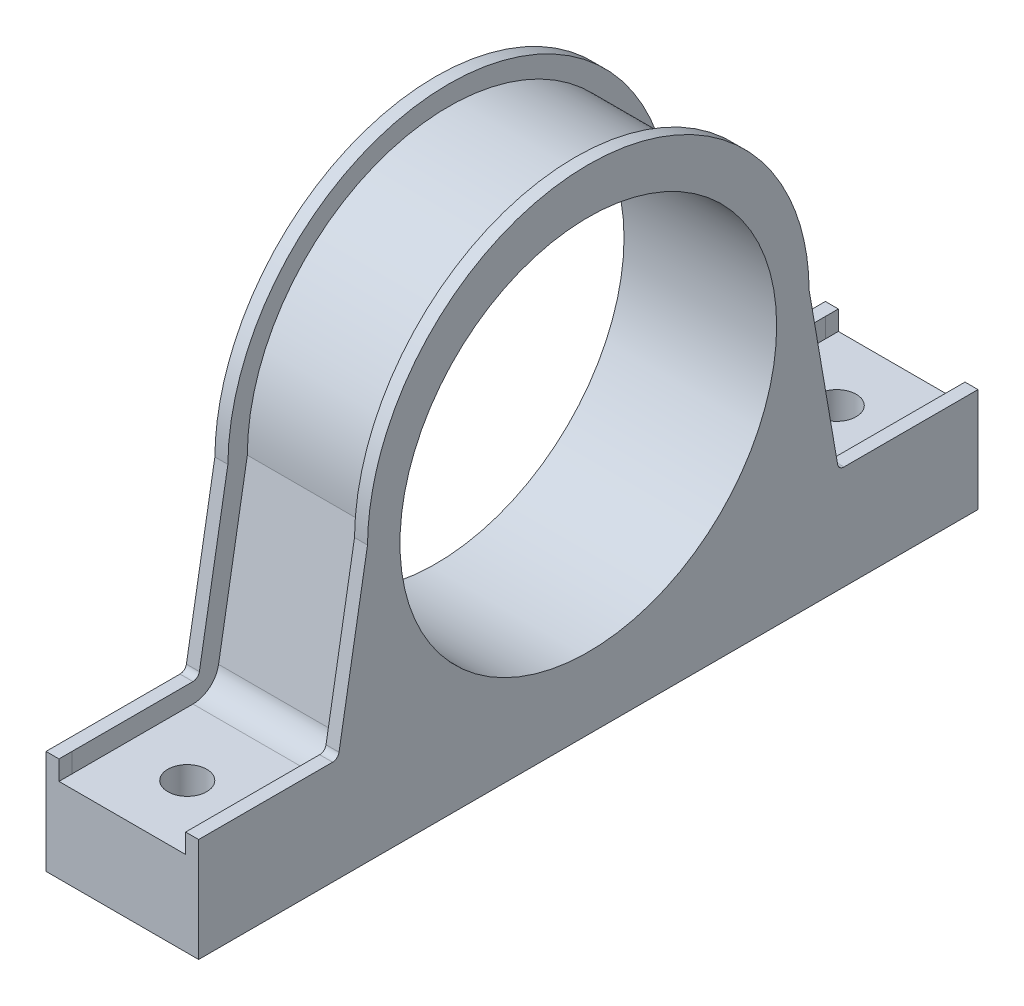
ISO-10303-21;
HEADER;
FILE_DESCRIPTION(('STEP AP214'),'2;1');
FILE_NAME('part.step','',(''),(''),'','','');
FILE_SCHEMA(('AUTOMOTIVE_DESIGN { 1 0 10303 214 1 1 1 1 }'));
ENDSEC;
DATA;
#1=APPLICATION_CONTEXT('core data for automotive mechanical design processes');
#2=APPLICATION_PROTOCOL_DEFINITION('international standard','automotive_design',2000,#1);
#3=PRODUCT_CONTEXT('',#1,'mechanical');
#4=PRODUCT('Part','Part','',(#3));
#5=PRODUCT_RELATED_PRODUCT_CATEGORY('part','',(#4));
#6=PRODUCT_DEFINITION_FORMATION('','',#4);
#7=PRODUCT_DEFINITION_CONTEXT('part definition',#1,'design');
#8=PRODUCT_DEFINITION('design','',#6,#7);
#9=PRODUCT_DEFINITION_SHAPE('','',#8);
#10=(LENGTH_UNIT() NAMED_UNIT(*) SI_UNIT(.MILLI.,.METRE.));
#11=(NAMED_UNIT(*) PLANE_ANGLE_UNIT() SI_UNIT($,.RADIAN.));
#12=(NAMED_UNIT(*) SI_UNIT($,.STERADIAN.) SOLID_ANGLE_UNIT());
#13=UNCERTAINTY_MEASURE_WITH_UNIT(LENGTH_MEASURE(1.E-05),#10,'distance_accuracy_value','');
#14=(GEOMETRIC_REPRESENTATION_CONTEXT(3) GLOBAL_UNCERTAINTY_ASSIGNED_CONTEXT((#13)) GLOBAL_UNIT_ASSIGNED_CONTEXT((#10,
#11,#12)) REPRESENTATION_CONTEXT('',''));
#15=CARTESIAN_POINT('',(0.,0.,0.));
#16=DIRECTION('',(0.,0.,1.));
#17=DIRECTION('',(1.,0.,0.));
#18=AXIS2_PLACEMENT_3D('',#15,#16,#17);
#19=CARTESIAN_POINT('',(23.5,0.,60.));
#20=DIRECTION('',(0.,0.,1.));
#21=DIRECTION('',(1.,0.,0.));
#22=AXIS2_PLACEMENT_3D('',#19,#20,#21);
#23=PLANE('',#22);
#24=DIRECTION('',(0.,1.,0.));
#25=VECTOR('',#24,1.);
#26=CARTESIAN_POINT('',(23.5,0.,60.));
#27=LINE('',#26,#25);
#28=CARTESIAN_POINT('',(23.5,-6.5,60.));
#29=VERTEX_POINT('',#28);
#30=CARTESIAN_POINT('',(23.5,9.5,60.));
#31=VERTEX_POINT('',#30);
#32=EDGE_CURVE('E377',#29,#31,#27,.T.);
#33=ORIENTED_EDGE('',*,*,#32,.T.);
#34=DIRECTION('',(1.,0.,0.));
#35=VECTOR('',#34,1.);
#36=CARTESIAN_POINT('',(0.,9.5,60.));
#37=LINE('',#36,#35);
#38=CARTESIAN_POINT('',(21.5,9.5,60.));
#39=VERTEX_POINT('',#38);
#40=EDGE_CURVE('E627',#39,#31,#37,.T.);
#41=ORIENTED_EDGE('',*,*,#40,.F.);
#42=DIRECTION('',(0.,1.,0.));
#43=VECTOR('',#42,1.);
#44=CARTESIAN_POINT('',(21.5,-500000.,60.));
#45=LINE('',#44,#43);
#46=CARTESIAN_POINT('',(21.5,6.5,60.));
#47=VERTEX_POINT('',#46);
#48=EDGE_CURVE('E521',#47,#39,#45,.T.);
#49=ORIENTED_EDGE('',*,*,#48,.F.);
#50=DIRECTION('',(-1.,0.,0.));
#51=VECTOR('',#50,1.);
#52=CARTESIAN_POINT('',(23.5,6.5,60.));
#53=LINE('',#52,#51);
#54=CARTESIAN_POINT('',(1.99999999999999,6.50000000001683,60.));
#55=VERTEX_POINT('',#54);
#56=EDGE_CURVE('E402',#47,#55,#53,.T.);
#57=ORIENTED_EDGE('',*,*,#56,.T.);
#58=DIRECTION('',(0.,1.,0.));
#59=VECTOR('',#58,1.);
#60=CARTESIAN_POINT('',(1.99999999999999,-500000.,60.));
#61=LINE('',#60,#59);
#62=CARTESIAN_POINT('',(1.99999999999999,9.50000000000273,60.));
#63=VERTEX_POINT('',#62);
#64=EDGE_CURVE('E323',#55,#63,#61,.T.);
#65=ORIENTED_EDGE('',*,*,#64,.T.);
#66=CARTESIAN_POINT('',(0.,9.5,60.));
#67=VERTEX_POINT('',#66);
#68=EDGE_CURVE('E51',#67,#63,#37,.T.);
#69=ORIENTED_EDGE('',*,*,#68,.F.);
#70=DIRECTION('',(0.,1.,0.));
#71=VECTOR('',#70,1.);
#72=CARTESIAN_POINT('',(0.,0.,60.));
#73=LINE('',#72,#71);
#74=CARTESIAN_POINT('',(0.,-6.5,60.));
#75=VERTEX_POINT('',#74);
#76=EDGE_CURVE('E319',#75,#67,#73,.T.);
#77=ORIENTED_EDGE('',*,*,#76,.F.);
#78=DIRECTION('',(-1.,0.,0.));
#79=VECTOR('',#78,1.);
#80=CARTESIAN_POINT('',(23.5,-6.5,60.));
#81=LINE('',#80,#79);
#82=EDGE_CURVE('E400',#29,#75,#81,.T.);
#83=ORIENTED_EDGE('',*,*,#82,.F.);
#84=EDGE_LOOP('',(#33,#41,#49,#57,#65,#69,#77,#83));
#85=FACE_BOUND('',#84,.T.);
#86=ADVANCED_FACE('F36',(#85),#23,.T.);
#87=CARTESIAN_POINT('',(23.5,0.,0.));
#88=DIRECTION('',(1.,0.,0.));
#89=DIRECTION('',(0.,0.,-1.));
#90=AXIS2_PLACEMENT_3D('',#87,#88,#89);
#91=PLANE('',#90);
#92=DIRECTION('',(0.,0.,1.));
#93=VECTOR('',#92,1.);
#94=CARTESIAN_POINT('',(23.5,9.5,0.));
#95=LINE('',#94,#93);
#96=CARTESIAN_POINT('',(23.5,9.5,39.369362474362));
#97=VERTEX_POINT('',#96);
#98=EDGE_CURVE('E634',#97,#31,#95,.T.);
#99=ORIENTED_EDGE('',*,*,#98,.T.);
#100=ORIENTED_EDGE('',*,*,#32,.F.);
#101=DIRECTION('',(0.,0.,-1.));
#102=VECTOR('',#101,1.);
#103=CARTESIAN_POINT('',(23.5,-6.5,0.));
#104=LINE('',#103,#102);
#105=CARTESIAN_POINT('',(23.5,-6.5,-60.));
#106=VERTEX_POINT('',#105);
#107=EDGE_CURVE('E381',#29,#106,#104,.T.);
#108=ORIENTED_EDGE('',*,*,#107,.T.);
#109=DIRECTION('',(0.,1.,0.));
#110=VECTOR('',#109,1.);
#111=CARTESIAN_POINT('',(23.5,0.,-60.));
#112=LINE('',#111,#110);
#113=CARTESIAN_POINT('',(23.5,9.5,-60.));
#114=VERTEX_POINT('',#113);
#115=EDGE_CURVE('E384',#106,#114,#112,.T.);
#116=ORIENTED_EDGE('',*,*,#115,.T.);
#117=DIRECTION('',(0.,0.,-1.));
#118=VECTOR('',#117,1.);
#119=CARTESIAN_POINT('',(23.5,9.5,0.));
#120=LINE('',#119,#118);
#121=CARTESIAN_POINT('',(23.5,9.5,-39.369362474362));
#122=VERTEX_POINT('',#121);
#123=EDGE_CURVE('E320',#122,#114,#120,.T.);
#124=ORIENTED_EDGE('',*,*,#123,.F.);
#125=CARTESIAN_POINT('',(23.5,10.5,-39.369362474362));
#126=DIRECTION('',(1.,0.,0.));
#127=DIRECTION('',(0.,0.,-1.));
#128=AXIS2_PLACEMENT_3D('',#125,#126,#127);
#129=CIRCLE('',#128,1.);
#130=CARTESIAN_POINT('',(23.5,10.330093083493,-38.3839023586175));
#131=VERTEX_POINT('',#130);
#132=EDGE_CURVE('E619',#131,#122,#129,.T.);
#133=ORIENTED_EDGE('',*,*,#132,.F.);
#134=DIRECTION('',(0.,0.985460115744309,0.169906916507871));
#135=VECTOR('',#134,1.);
#136=CARTESIAN_POINT('',(23.5,6.7250787171994,-39.0054565597035));
#137=LINE('',#136,#135);
#138=CARTESIAN_POINT('',(23.5,27.4770990914213,-35.4275220124189));
#139=VERTEX_POINT('',#138);
#140=EDGE_CURVE('E453',#131,#139,#137,.T.);
#141=ORIENTED_EDGE('',*,*,#140,.T.);
#142=CARTESIAN_POINT('',(23.5,35.7626090324103,-33.9989858156948));
#143=VERTEX_POINT('',#142);
#144=EDGE_CURVE('E660',#139,#143,#137,.T.);
#145=ORIENTED_EDGE('',*,*,#144,.T.);
#146=CARTESIAN_POINT('',(23.5,35.5,0.));
#147=DIRECTION('',(1.,0.,0.));
#148=DIRECTION('',(0.,0.,-1.));
#149=AXIS2_PLACEMENT_3D('',#146,#147,#148);
#150=CIRCLE('',#149,33.9999999999959);
#151=CARTESIAN_POINT('',(23.5,49.4642400437589,-31.));
#152=VERTEX_POINT('',#151);
#153=EDGE_CURVE('E658',#143,#152,#150,.T.);
#154=ORIENTED_EDGE('',*,*,#153,.T.);
#155=CARTESIAN_POINT('',(23.5,49.4642400437589,31.));
#156=VERTEX_POINT('',#155);
#157=EDGE_CURVE('E661',#152,#156,#150,.T.);
#158=ORIENTED_EDGE('',*,*,#157,.T.);
#159=CARTESIAN_POINT('',(23.5,35.7626090324465,33.9989858156945));
#160=VERTEX_POINT('',#159);
#161=EDGE_CURVE('E657',#156,#160,#150,.T.);
#162=ORIENTED_EDGE('',*,*,#161,.T.);
#163=DIRECTION('',(0.,0.985460115744348,-0.169906916507646));
#164=VECTOR('',#163,1.);
#165=CARTESIAN_POINT('',(23.5,6.72507871719035,39.0054565597042));
#166=LINE('',#165,#164);
#167=CARTESIAN_POINT('',(23.5,27.4770990970526,35.4275220114521));
#168=VERTEX_POINT('',#167);
#169=EDGE_CURVE('E654',#168,#160,#166,.T.);
#170=ORIENTED_EDGE('',*,*,#169,.F.);
#171=CARTESIAN_POINT('',(23.5,10.3300930834924,38.3839023586176));
#172=VERTEX_POINT('',#171);
#173=EDGE_CURVE('E655',#172,#168,#166,.T.);
#174=ORIENTED_EDGE('',*,*,#173,.F.);
#175=CARTESIAN_POINT('',(23.5,10.5,39.369362474362));
#176=DIRECTION('',(1.,0.,0.));
#177=DIRECTION('',(0.,0.,-1.));
#178=AXIS2_PLACEMENT_3D('',#175,#176,#177);
#179=CIRCLE('',#178,0.999999999999999);
#180=EDGE_CURVE('E640',#97,#172,#179,.T.);
#181=ORIENTED_EDGE('',*,*,#180,.F.);
#182=EDGE_LOOP('',(#99,#100,#108,#116,#124,#133,#141,#145,#154,#158,#162,#170,#174,#181));
#183=FACE_BOUND('',#182,.T.);
#184=CARTESIAN_POINT('',(23.5,33.5,0.));
#185=DIRECTION('',(1.,0.,0.));
#186=DIRECTION('',(0.,0.,-1.));
#187=AXIS2_PLACEMENT_3D('',#184,#185,#186);
#188=CIRCLE('',#187,29.);
#189=CARTESIAN_POINT('',(23.5,33.5,-29.));
#190=VERTEX_POINT('',#189);
#191=EDGE_CURVE('E374',#190,#190,#188,.T.);
#192=ORIENTED_EDGE('',*,*,#191,.F.);
#193=EDGE_LOOP('',(#192));
#194=FACE_BOUND('',#193,.T.);
#195=ADVANCED_FACE('F622',(#183,#194),#91,.T.);
#196=CARTESIAN_POINT('',(0.,0.,0.));
#197=DIRECTION('',(1.,0.,0.));
#198=DIRECTION('',(0.,0.,-1.));
#199=AXIS2_PLACEMENT_3D('',#196,#197,#198);
#200=PLANE('',#199);
#201=CARTESIAN_POINT('',(0.,33.5,0.));
#202=DIRECTION('',(1.,0.,0.));
#203=DIRECTION('',(0.,0.,-1.));
#204=AXIS2_PLACEMENT_3D('',#201,#202,#203);
#205=CIRCLE('',#204,29.);
#206=CARTESIAN_POINT('',(0.,33.5,-29.));
#207=VERTEX_POINT('',#206);
#208=EDGE_CURVE('E373',#207,#207,#205,.T.);
#209=ORIENTED_EDGE('',*,*,#208,.T.);
#210=EDGE_LOOP('',(#209));
#211=FACE_BOUND('',#210,.T.);
#212=DIRECTION('',(0.,0.,-1.));
#213=VECTOR('',#212,1.);
#214=CARTESIAN_POINT('',(0.,9.5,0.));
#215=LINE('',#214,#213);
#216=CARTESIAN_POINT('',(0.,9.5,-39.369362474362));
#217=VERTEX_POINT('',#216);
#218=CARTESIAN_POINT('',(0.,9.5,-60.));
#219=VERTEX_POINT('',#218);
#220=EDGE_CURVE('E612',#217,#219,#215,.T.);
#221=ORIENTED_EDGE('',*,*,#220,.T.);
#222=DIRECTION('',(0.,1.,0.));
#223=VECTOR('',#222,1.);
#224=CARTESIAN_POINT('',(0.,0.,-60.));
#225=LINE('',#224,#223);
#226=CARTESIAN_POINT('',(0.,-6.5,-60.));
#227=VERTEX_POINT('',#226);
#228=EDGE_CURVE('E378',#227,#219,#225,.T.);
#229=ORIENTED_EDGE('',*,*,#228,.F.);
#230=DIRECTION('',(0.,0.,-1.));
#231=VECTOR('',#230,1.);
#232=CARTESIAN_POINT('',(0.,-6.5,0.));
#233=LINE('',#232,#231);
#234=EDGE_CURVE('E391',#75,#227,#233,.T.);
#235=ORIENTED_EDGE('',*,*,#234,.F.);
#236=ORIENTED_EDGE('',*,*,#76,.T.);
#237=DIRECTION('',(0.,0.,1.));
#238=VECTOR('',#237,1.);
#239=CARTESIAN_POINT('',(0.,9.5,0.));
#240=LINE('',#239,#238);
#241=CARTESIAN_POINT('',(0.,9.5,39.369362474362));
#242=VERTEX_POINT('',#241);
#243=EDGE_CURVE('E294',#242,#67,#240,.T.);
#244=ORIENTED_EDGE('',*,*,#243,.F.);
#245=CARTESIAN_POINT('',(0.,10.5,39.369362474362));
#246=DIRECTION('',(1.,0.,0.));
#247=DIRECTION('',(0.,0.,-1.));
#248=AXIS2_PLACEMENT_3D('',#245,#246,#247);
#249=CIRCLE('',#248,0.999999999999999);
#250=CARTESIAN_POINT('',(0.,10.3300930834924,38.3839023586176));
#251=VERTEX_POINT('',#250);
#252=EDGE_CURVE('E303',#242,#251,#249,.T.);
#253=ORIENTED_EDGE('',*,*,#252,.T.);
#254=DIRECTION('',(0.,0.985460115744348,-0.169906916507646));
#255=VECTOR('',#254,1.);
#256=CARTESIAN_POINT('',(0.,6.72507871719035,39.0054565597042));
#257=LINE('',#256,#255);
#258=CARTESIAN_POINT('',(0.,27.4770990970526,35.4275220114521));
#259=VERTEX_POINT('',#258);
#260=EDGE_CURVE('E1058',#251,#259,#257,.T.);
#261=ORIENTED_EDGE('',*,*,#260,.T.);
#262=CARTESIAN_POINT('',(0.,35.7626090324465,33.9989858156945));
#263=VERTEX_POINT('',#262);
#264=EDGE_CURVE('E311',#259,#263,#257,.T.);
#265=ORIENTED_EDGE('',*,*,#264,.T.);
#266=CARTESIAN_POINT('',(0.,35.5,0.));
#267=DIRECTION('',(1.,0.,0.));
#268=DIRECTION('',(0.,0.,-1.));
#269=AXIS2_PLACEMENT_3D('',#266,#267,#268);
#270=CIRCLE('',#269,33.9999999999959);
#271=CARTESIAN_POINT('',(0.,49.4642400437589,31.));
#272=VERTEX_POINT('',#271);
#273=EDGE_CURVE('E1056',#272,#263,#270,.T.);
#274=ORIENTED_EDGE('',*,*,#273,.F.);
#275=CARTESIAN_POINT('',(0.,49.4642400437589,-31.));
#276=VERTEX_POINT('',#275);
#277=EDGE_CURVE('E1054',#276,#272,#270,.T.);
#278=ORIENTED_EDGE('',*,*,#277,.F.);
#279=CARTESIAN_POINT('',(0.,35.7626090324103,-33.9989858156948));
#280=VERTEX_POINT('',#279);
#281=EDGE_CURVE('E1053',#280,#276,#270,.T.);
#282=ORIENTED_EDGE('',*,*,#281,.F.);
#283=DIRECTION('',(0.,0.985460115744309,0.169906916507871));
#284=VECTOR('',#283,1.);
#285=CARTESIAN_POINT('',(0.,6.7250787171994,-39.0054565597035));
#286=LINE('',#285,#284);
#287=CARTESIAN_POINT('',(0.,27.4770990914213,-35.4275220124189));
#288=VERTEX_POINT('',#287);
#289=EDGE_CURVE('E1051',#288,#280,#286,.T.);
#290=ORIENTED_EDGE('',*,*,#289,.F.);
#291=CARTESIAN_POINT('',(0.,10.330093083493,-38.3839023586175));
#292=VERTEX_POINT('',#291);
#293=EDGE_CURVE('E648',#292,#288,#286,.T.);
#294=ORIENTED_EDGE('',*,*,#293,.F.);
#295=CARTESIAN_POINT('',(0.,10.5,-39.369362474362));
#296=DIRECTION('',(1.,0.,0.));
#297=DIRECTION('',(0.,0.,-1.));
#298=AXIS2_PLACEMENT_3D('',#295,#296,#297);
#299=CIRCLE('',#298,1.);
#300=EDGE_CURVE('E646',#292,#217,#299,.T.);
#301=ORIENTED_EDGE('',*,*,#300,.T.);
#302=EDGE_LOOP('',(#221,#229,#235,#236,#244,#253,#261,#265,#274,#278,#282,#290,#294,#301));
#303=FACE_BOUND('',#302,.T.);
#304=ADVANCED_FACE('F315',(#211,#303),#200,.F.);
#305=CARTESIAN_POINT('',(1.99999999999999,-500000.,58.));
#306=DIRECTION('',(-1.,0.,0.));
#307=DIRECTION('',(0.,0.,1.));
#308=AXIS2_PLACEMENT_3D('',#305,#306,#307);
#309=PLANE('',#308);
#310=DIRECTION('',(0.,0.,-1.));
#311=VECTOR('',#310,1.);
#312=CARTESIAN_POINT('',(1.99999999999999,9.50000000000273,58.));
#313=LINE('',#312,#311);
#314=CARTESIAN_POINT('',(1.99999999999999,9.50000000000273,58.));
#315=VERTEX_POINT('',#314);
#316=CARTESIAN_POINT('',(1.99999999999999,9.5,39.369362474362));
#317=VERTEX_POINT('',#316);
#318=EDGE_CURVE('E296',#315,#317,#313,.T.);
#319=ORIENTED_EDGE('',*,*,#318,.F.);
#320=DIRECTION('',(0.,1.,0.));
#321=VECTOR('',#320,1.);
#322=CARTESIAN_POINT('',(1.99999999999999,-500000.,58.));
#323=LINE('',#322,#321);
#324=CARTESIAN_POINT('',(1.99999999999999,6.50000000001683,58.));
#325=VERTEX_POINT('',#324);
#326=EDGE_CURVE('E329',#325,#315,#323,.T.);
#327=ORIENTED_EDGE('',*,*,#326,.F.);
#328=DIRECTION('',(0.,0.,-1.));
#329=VECTOR('',#328,1.);
#330=CARTESIAN_POINT('',(1.99999999999999,6.50000000001683,58.));
#331=LINE('',#330,#329);
#332=CARTESIAN_POINT('',(1.99999999999999,6.5,39.369362474362));
#333=VERTEX_POINT('',#332);
#334=EDGE_CURVE('E347',#325,#333,#331,.T.);
#335=ORIENTED_EDGE('',*,*,#334,.T.);
#336=CARTESIAN_POINT('',(1.99999999999999,10.5,39.369362474362));
#337=DIRECTION('',(-1.,0.,0.));
#338=DIRECTION('',(0.,0.,1.));
#339=AXIS2_PLACEMENT_3D('',#336,#337,#338);
#340=CIRCLE('',#339,4.);
#341=CARTESIAN_POINT('',(1.99999999999999,9.82037233393385,35.4275220113891));
#342=VERTEX_POINT('',#341);
#343=EDGE_CURVE('E348',#342,#333,#340,.T.);
#344=ORIENTED_EDGE('',*,*,#343,.F.);
#345=DIRECTION('',(0.,-0.985460115744348,0.169906916507646));
#346=VECTOR('',#345,1.);
#347=CARTESIAN_POINT('',(1.99999999999999,-485569.315819862,83755.9682448035));
#348=LINE('',#347,#346);
#349=CARTESIAN_POINT('',(1.99999999999999,35.5,31.));
#350=VERTEX_POINT('',#349);
#351=EDGE_CURVE('E351',#350,#342,#348,.T.);
#352=ORIENTED_EDGE('',*,*,#351,.F.);
#353=CARTESIAN_POINT('',(1.99999999999999,35.5,0.));
#354=DIRECTION('',(-1.,0.,0.));
#355=DIRECTION('',(0.,0.,1.));
#356=AXIS2_PLACEMENT_3D('',#353,#354,#355);
#357=CIRCLE('',#356,31.);
#358=CARTESIAN_POINT('',(1.99999999999999,35.5000000000132,-30.9999999999917));
#359=VERTEX_POINT('',#358);
#360=EDGE_CURVE('E357',#359,#350,#357,.F.);
#361=ORIENTED_EDGE('',*,*,#360,.F.);
#362=DIRECTION('',(0.,-0.985460115744348,-0.169906916507646));
#363=VECTOR('',#362,1.);
#364=CARTESIAN_POINT('',(1.99999999999999,-485549.893187067,-83752.6195150116));
#365=LINE('',#364,#363);
#366=CARTESIAN_POINT('',(1.99999999999999,9.82037233393385,-35.4275220113891));
#367=VERTEX_POINT('',#366);
#368=EDGE_CURVE('E546',#359,#367,#365,.T.);
#369=ORIENTED_EDGE('',*,*,#368,.T.);
#370=CARTESIAN_POINT('',(1.99999999999999,10.5,-39.369362474362));
#371=DIRECTION('',(-1.,0.,0.));
#372=DIRECTION('',(0.,0.,1.));
#373=AXIS2_PLACEMENT_3D('',#370,#371,#372);
#374=CIRCLE('',#373,4.);
#375=CARTESIAN_POINT('',(1.99999999999999,6.5,-39.369362474362));
#376=VERTEX_POINT('',#375);
#377=EDGE_CURVE('E360',#376,#367,#374,.T.);
#378=ORIENTED_EDGE('',*,*,#377,.F.);
#379=DIRECTION('',(0.,0.,1.));
#380=VECTOR('',#379,1.);
#381=CARTESIAN_POINT('',(1.99999999999999,6.50000000001683,58.));
#382=LINE('',#381,#380);
#383=CARTESIAN_POINT('',(1.99999999999999,6.50000000001683,-58.));
#384=VERTEX_POINT('',#383);
#385=EDGE_CURVE('E354',#384,#376,#382,.T.);
#386=ORIENTED_EDGE('',*,*,#385,.F.);
#387=DIRECTION('',(0.,1.,0.));
#388=VECTOR('',#387,1.);
#389=CARTESIAN_POINT('',(1.99999999999999,-500000.,-58.));
#390=LINE('',#389,#388);
#391=CARTESIAN_POINT('',(1.99999999999999,9.50000000000273,-58.));
#392=VERTEX_POINT('',#391);
#393=EDGE_CURVE('E554',#384,#392,#390,.T.);
#394=ORIENTED_EDGE('',*,*,#393,.T.);
#395=DIRECTION('',(0.,0.,1.));
#396=VECTOR('',#395,1.);
#397=CARTESIAN_POINT('',(1.99999999999999,9.50000000000273,58.));
#398=LINE('',#397,#396);
#399=CARTESIAN_POINT('',(1.99999999999999,9.5,-39.369362474362));
#400=VERTEX_POINT('',#399);
#401=EDGE_CURVE('E472',#392,#400,#398,.T.);
#402=ORIENTED_EDGE('',*,*,#401,.T.);
#403=CARTESIAN_POINT('',(1.99999999999999,10.5,-39.369362474362));
#404=DIRECTION('',(-1.,0.,0.));
#405=DIRECTION('',(0.,0.,1.));
#406=AXIS2_PLACEMENT_3D('',#403,#404,#405);
#407=CIRCLE('',#406,1.);
#408=CARTESIAN_POINT('',(1.99999999999999,10.330093083493,-38.3839023586175));
#409=VERTEX_POINT('',#408);
#410=EDGE_CURVE('E487',#400,#409,#407,.T.);
#411=ORIENTED_EDGE('',*,*,#410,.T.);
#412=DIRECTION('',(0.,-0.985460115744309,-0.169906916507871));
#413=VECTOR('',#412,1.);
#414=CARTESIAN_POINT('',(1.99999999999999,-485549.383466279,-83755.5758954661));
#415=LINE('',#414,#413);
#416=CARTESIAN_POINT('',(1.99999999999999,35.7626090324103,-33.9989858156948));
#417=VERTEX_POINT('',#416);
#418=EDGE_CURVE('E485',#417,#409,#415,.T.);
#419=ORIENTED_EDGE('',*,*,#418,.F.);
#420=CARTESIAN_POINT('',(1.99999999999999,35.5,0.));
#421=DIRECTION('',(-1.,0.,0.));
#422=DIRECTION('',(0.,0.,1.));
#423=AXIS2_PLACEMENT_3D('',#420,#421,#422);
#424=CIRCLE('',#423,33.9999999999959);
#425=CARTESIAN_POINT('',(1.99999999999999,35.7626090324465,33.9989858156945));
#426=VERTEX_POINT('',#425);
#427=EDGE_CURVE('E483',#426,#417,#424,.T.);
#428=ORIENTED_EDGE('',*,*,#427,.F.);
#429=DIRECTION('',(0.,-0.985460115744348,0.169906916507646));
#430=VECTOR('',#429,1.);
#431=CARTESIAN_POINT('',(1.99999999999999,-485568.806099112,83758.9246251507));
#432=LINE('',#431,#430);
#433=CARTESIAN_POINT('',(1.99999999999999,10.3300930834924,38.3839023586176));
#434=VERTEX_POINT('',#433);
#435=EDGE_CURVE('E480',#426,#434,#432,.T.);
#436=ORIENTED_EDGE('',*,*,#435,.T.);
#437=CARTESIAN_POINT('',(1.99999999999999,10.5,39.369362474362));
#438=DIRECTION('',(-1.,0.,0.));
#439=DIRECTION('',(0.,0.,1.));
#440=AXIS2_PLACEMENT_3D('',#437,#438,#439);
#441=CIRCLE('',#440,0.999999999999999);
#442=EDGE_CURVE('E478',#434,#317,#441,.T.);
#443=ORIENTED_EDGE('',*,*,#442,.T.);
#444=EDGE_LOOP('',(#319,#327,#335,#344,#352,#361,#369,#378,#386,#394,#402,#411,#419,#428,#436,#443));
#445=FACE_BOUND('',#444,.T.);
#446=ADVANCED_FACE('F564',(#445),#309,.F.);
#447=CARTESIAN_POINT('',(1.99999999999999,-500000.,58.));
#448=DIRECTION('',(-1.,0.,0.));
#449=DIRECTION('',(0.,0.,1.));
#450=AXIS2_PLACEMENT_3D('',#447,#448,#449);
#451=PLANE('',#450);
#452=DIRECTION('',(0.,0.,-1.));
#453=VECTOR('',#452,1.);
#454=CARTESIAN_POINT('',(1.99999999999999,9.50000000000273,58.));
#455=LINE('',#454,#453);
#456=EDGE_CURVE('E492',#63,#315,#455,.T.);
#457=ORIENTED_EDGE('',*,*,#456,.F.);
#458=ORIENTED_EDGE('',*,*,#64,.F.);
#459=DIRECTION('',(0.,0.,-1.));
#460=VECTOR('',#459,1.);
#461=CARTESIAN_POINT('',(1.99999999999999,6.50000000001683,58.));
#462=LINE('',#461,#460);
#463=EDGE_CURVE('E547',#55,#325,#462,.T.);
#464=ORIENTED_EDGE('',*,*,#463,.T.);
#465=ORIENTED_EDGE('',*,*,#326,.T.);
#466=EDGE_LOOP('',(#457,#458,#464,#465));
#467=FACE_BOUND('',#466,.T.);
#468=ADVANCED_FACE('F559',(#467),#451,.F.);
#469=CARTESIAN_POINT('',(21.5,-500000.,58.));
#470=DIRECTION('',(1.,0.,0.));
#471=DIRECTION('',(0.,0.,-1.));
#472=AXIS2_PLACEMENT_3D('',#469,#470,#471);
#473=PLANE('',#472);
#474=DIRECTION('',(0.,0.,1.));
#475=VECTOR('',#474,1.);
#476=CARTESIAN_POINT('',(21.5,9.50000000000273,58.));
#477=LINE('',#476,#475);
#478=CARTESIAN_POINT('',(21.5,9.50000000000273,58.));
#479=VERTEX_POINT('',#478);
#480=EDGE_CURVE('E490',#479,#39,#477,.T.);
#481=ORIENTED_EDGE('',*,*,#480,.F.);
#482=DIRECTION('',(0.,1.,0.));
#483=VECTOR('',#482,1.);
#484=CARTESIAN_POINT('',(21.5,-500000.,58.));
#485=LINE('',#484,#483);
#486=CARTESIAN_POINT('',(21.5,6.5,58.));
#487=VERTEX_POINT('',#486);
#488=EDGE_CURVE('E524',#487,#479,#485,.T.);
#489=ORIENTED_EDGE('',*,*,#488,.F.);
#490=DIRECTION('',(0.,0.,1.));
#491=VECTOR('',#490,1.);
#492=CARTESIAN_POINT('',(21.5,6.50000000001683,58.));
#493=LINE('',#492,#491);
#494=EDGE_CURVE('E496',#487,#47,#493,.T.);
#495=ORIENTED_EDGE('',*,*,#494,.T.);
#496=ORIENTED_EDGE('',*,*,#48,.T.);
#497=EDGE_LOOP('',(#481,#489,#495,#496));
#498=FACE_BOUND('',#497,.T.);
#499=ADVANCED_FACE('F678',(#498),#473,.F.);
#500=CARTESIAN_POINT('',(21.5,-500000.,58.));
#501=DIRECTION('',(1.,0.,0.));
#502=DIRECTION('',(0.,0.,-1.));
#503=AXIS2_PLACEMENT_3D('',#500,#501,#502);
#504=PLANE('',#503);
#505=DIRECTION('',(0.,0.,1.));
#506=VECTOR('',#505,1.);
#507=CARTESIAN_POINT('',(21.5,9.50000000000273,58.));
#508=LINE('',#507,#506);
#509=CARTESIAN_POINT('',(21.5,9.5,39.369362474362));
#510=VERTEX_POINT('',#509);
#511=EDGE_CURVE('E11',#510,#479,#508,.T.);
#512=ORIENTED_EDGE('',*,*,#511,.F.);
#513=CARTESIAN_POINT('',(21.5,10.5,39.369362474362));
#514=DIRECTION('',(1.,0.,0.));
#515=DIRECTION('',(0.,0.,-1.));
#516=AXIS2_PLACEMENT_3D('',#513,#514,#515);
#517=CIRCLE('',#516,0.999999999999999);
#518=CARTESIAN_POINT('',(21.5,10.3300930834924,38.3839023586176));
#519=VERTEX_POINT('',#518);
#520=EDGE_CURVE('E422',#510,#519,#517,.T.);
#521=ORIENTED_EDGE('',*,*,#520,.T.);
#522=DIRECTION('',(0.,0.985460115744348,-0.169906916507646));
#523=VECTOR('',#522,1.);
#524=CARTESIAN_POINT('',(21.49999999997,-485568.806099112,83758.9246251507));
#525=LINE('',#524,#523);
#526=CARTESIAN_POINT('',(21.5,35.7626090324465,33.9989858156945));
#527=VERTEX_POINT('',#526);
#528=EDGE_CURVE('E425',#519,#527,#525,.T.);
#529=ORIENTED_EDGE('',*,*,#528,.T.);
#530=CARTESIAN_POINT('',(21.5,35.5,0.));
#531=DIRECTION('',(1.,0.,0.));
#532=DIRECTION('',(0.,0.,-1.));
#533=AXIS2_PLACEMENT_3D('',#530,#531,#532);
#534=CIRCLE('',#533,33.9999999999959);
#535=CARTESIAN_POINT('',(21.5,35.7626090324103,-33.9989858156948));
#536=VERTEX_POINT('',#535);
#537=EDGE_CURVE('E428',#536,#527,#534,.T.);
#538=ORIENTED_EDGE('',*,*,#537,.F.);
#539=DIRECTION('',(0.,0.985460115744309,0.169906916507871));
#540=VECTOR('',#539,1.);
#541=CARTESIAN_POINT('',(21.5000000000301,-485549.383466279,-83755.5758954661));
#542=LINE('',#541,#540);
#543=CARTESIAN_POINT('',(21.5,10.330093083493,-38.3839023586175));
#544=VERTEX_POINT('',#543);
#545=EDGE_CURVE('E430',#544,#536,#542,.T.);
#546=ORIENTED_EDGE('',*,*,#545,.F.);
#547=CARTESIAN_POINT('',(21.5,10.5,-39.369362474362));
#548=DIRECTION('',(1.,0.,0.));
#549=DIRECTION('',(0.,0.,-1.));
#550=AXIS2_PLACEMENT_3D('',#547,#548,#549);
#551=CIRCLE('',#550,1.);
#552=CARTESIAN_POINT('',(21.5,9.5,-39.369362474362));
#553=VERTEX_POINT('',#552);
#554=EDGE_CURVE('E44',#544,#553,#551,.T.);
#555=ORIENTED_EDGE('',*,*,#554,.T.);
#556=DIRECTION('',(0.,0.,-1.));
#557=VECTOR('',#556,1.);
#558=CARTESIAN_POINT('',(21.5,9.50000000000273,58.));
#559=LINE('',#558,#557);
#560=CARTESIAN_POINT('',(21.5000000000001,9.50000000000273,-58.));
#561=VERTEX_POINT('',#560);
#562=EDGE_CURVE('E438',#553,#561,#559,.T.);
#563=ORIENTED_EDGE('',*,*,#562,.T.);
#564=DIRECTION('',(0.,1.,0.));
#565=VECTOR('',#564,1.);
#566=CARTESIAN_POINT('',(21.5000000000001,-500000.,-58.));
#567=LINE('',#566,#565);
#568=CARTESIAN_POINT('',(21.5000000000001,6.5,-58.));
#569=VERTEX_POINT('',#568);
#570=EDGE_CURVE('E527',#569,#561,#567,.T.);
#571=ORIENTED_EDGE('',*,*,#570,.F.);
#572=DIRECTION('',(0.,0.,-1.));
#573=VECTOR('',#572,1.);
#574=CARTESIAN_POINT('',(21.5,6.50000000001683,58.));
#575=LINE('',#574,#573);
#576=CARTESIAN_POINT('',(21.5,6.5,-39.369362474362));
#577=VERTEX_POINT('',#576);
#578=EDGE_CURVE('E500',#577,#569,#575,.T.);
#579=ORIENTED_EDGE('',*,*,#578,.F.);
#580=CARTESIAN_POINT('',(21.5,10.5,-39.369362474362));
#581=DIRECTION('',(1.,0.,0.));
#582=DIRECTION('',(0.,0.,-1.));
#583=AXIS2_PLACEMENT_3D('',#580,#581,#582);
#584=CIRCLE('',#583,4.);
#585=CARTESIAN_POINT('',(21.5,9.82037233396941,-35.4275220113846));
#586=VERTEX_POINT('',#585);
#587=EDGE_CURVE('E541',#586,#577,#584,.T.);
#588=ORIENTED_EDGE('',*,*,#587,.F.);
#589=DIRECTION('',(0.,0.985460115744348,0.169906916507646));
#590=VECTOR('',#589,1.);
#591=CARTESIAN_POINT('',(21.5000000000301,-485549.893187067,-83752.6195150116));
#592=LINE('',#591,#590);
#593=CARTESIAN_POINT('',(21.5,35.5,-31.));
#594=VERTEX_POINT('',#593);
#595=EDGE_CURVE('E503',#586,#594,#592,.T.);
#596=ORIENTED_EDGE('',*,*,#595,.T.);
#597=CARTESIAN_POINT('',(21.5,35.5,0.));
#598=DIRECTION('',(1.,0.,0.));
#599=DIRECTION('',(0.,0.,-1.));
#600=AXIS2_PLACEMENT_3D('',#597,#598,#599);
#601=CIRCLE('',#600,31.);
#602=CARTESIAN_POINT('',(21.5,35.5,31.));
#603=VERTEX_POINT('',#602);
#604=EDGE_CURVE('E539',#603,#594,#601,.F.);
#605=ORIENTED_EDGE('',*,*,#604,.F.);
#606=DIRECTION('',(0.,0.985460115744348,-0.169906916507646));
#607=VECTOR('',#606,1.);
#608=CARTESIAN_POINT('',(21.49999999997,-485569.315819862,83755.9682448035));
#609=LINE('',#608,#607);
#610=CARTESIAN_POINT('',(21.5,9.82037233396941,35.4275220113846));
#611=VERTEX_POINT('',#610);
#612=EDGE_CURVE('E537',#611,#603,#609,.T.);
#613=ORIENTED_EDGE('',*,*,#612,.F.);
#614=CARTESIAN_POINT('',(21.5,10.5,39.369362474362));
#615=DIRECTION('',(1.,0.,0.));
#616=DIRECTION('',(0.,0.,-1.));
#617=AXIS2_PLACEMENT_3D('',#614,#615,#616);
#618=CIRCLE('',#617,4.);
#619=CARTESIAN_POINT('',(21.5,6.5,39.369362474362));
#620=VERTEX_POINT('',#619);
#621=EDGE_CURVE('E535',#620,#611,#618,.T.);
#622=ORIENTED_EDGE('',*,*,#621,.F.);
#623=DIRECTION('',(0.,0.,1.));
#624=VECTOR('',#623,1.);
#625=CARTESIAN_POINT('',(21.5,6.50000000001683,58.));
#626=LINE('',#625,#624);
#627=EDGE_CURVE('E499',#620,#487,#626,.T.);
#628=ORIENTED_EDGE('',*,*,#627,.T.);
#629=ORIENTED_EDGE('',*,*,#488,.T.);
#630=EDGE_LOOP('',(#512,#521,#529,#538,#546,#555,#563,#571,#579,#588,#596,#605,#613,#622,#628,#629));
#631=FACE_BOUND('',#630,.T.);
#632=ADVANCED_FACE('F436',(#631),#504,.F.);
#633=CARTESIAN_POINT('',(23.5,6.21535796766744,-36.0490762124711));
#634=DIRECTION('',(0.,0.169906916507646,-0.985460115744348));
#635=DIRECTION('',(0.,0.985460115744348,0.169906916507646));
#636=AXIS2_PLACEMENT_3D('',#633,#634,#635);
#637=PLANE('',#636);
#638=DIRECTION('',(-1.,0.,0.));
#639=VECTOR('',#638,1.);
#640=CARTESIAN_POINT('',(23.5,35.5,-31.));
#641=LINE('',#640,#639);
#642=EDGE_CURVE('E406',#594,#359,#641,.T.);
#643=ORIENTED_EDGE('',*,*,#642,.F.);
#644=ORIENTED_EDGE('',*,*,#595,.F.);
#645=DIRECTION('',(-1.,0.,0.));
#646=VECTOR('',#645,1.);
#647=CARTESIAN_POINT('',(23.5,9.82037233396941,-35.4275220113846));
#648=LINE('',#647,#646);
#649=EDGE_CURVE('E415',#586,#367,#648,.T.);
#650=ORIENTED_EDGE('',*,*,#649,.T.);
#651=ORIENTED_EDGE('',*,*,#368,.F.);
#652=EDGE_LOOP('',(#643,#644,#650,#651));
#653=FACE_BOUND('',#652,.T.);
#654=ADVANCED_FACE('F585',(#653),#637,.T.);
#655=CARTESIAN_POINT('',(23.5,35.5,0.));
#656=DIRECTION('',(-1.,0.,0.));
#657=DIRECTION('',(0.,0.,1.));
#658=AXIS2_PLACEMENT_3D('',#655,#656,#657);
#659=CYLINDRICAL_SURFACE('',#658,31.);
#660=ORIENTED_EDGE('',*,*,#604,.T.);
#661=ORIENTED_EDGE('',*,*,#642,.T.);
#662=ORIENTED_EDGE('',*,*,#360,.T.);
#663=DIRECTION('',(-1.,0.,0.));
#664=VECTOR('',#663,1.);
#665=CARTESIAN_POINT('',(23.5,35.5,31.));
#666=LINE('',#665,#664);
#667=EDGE_CURVE('E404',#603,#350,#666,.T.);
#668=ORIENTED_EDGE('',*,*,#667,.F.);
#669=EDGE_LOOP('',(#660,#661,#662,#668));
#670=FACE_BOUND('',#669,.T.);
#671=ADVANCED_FACE('F580',(#670),#659,.T.);
#672=CARTESIAN_POINT('',(23.5,6.21535796766742,36.0490762124711));
#673=DIRECTION('',(0.,-0.169906916507646,-0.985460115744348));
#674=DIRECTION('',(0.,0.985460115744348,-0.169906916507646));
#675=AXIS2_PLACEMENT_3D('',#672,#673,#674);
#676=PLANE('',#675);
#677=ORIENTED_EDGE('',*,*,#612,.T.);
#678=ORIENTED_EDGE('',*,*,#667,.T.);
#679=ORIENTED_EDGE('',*,*,#351,.T.);
#680=DIRECTION('',(-1.,0.,0.));
#681=VECTOR('',#680,1.);
#682=CARTESIAN_POINT('',(23.5,9.82037233396941,35.4275220113846));
#683=LINE('',#682,#681);
#684=EDGE_CURVE('E412',#342,#611,#683,.F.);
#685=ORIENTED_EDGE('',*,*,#684,.T.);
#686=EDGE_LOOP('',(#677,#678,#679,#685));
#687=FACE_BOUND('',#686,.T.);
#688=ADVANCED_FACE('F577',(#687),#676,.F.);
#689=CARTESIAN_POINT('',(23.5,6.5,0.));
#690=DIRECTION('',(0.,1.,0.));
#691=DIRECTION('',(0.,0.,1.));
#692=AXIS2_PLACEMENT_3D('',#689,#690,#691);
#693=PLANE('',#692);
#694=CARTESIAN_POINT('',(11.75,6.5,50.));
#695=DIRECTION('',(0.,1.,0.));
#696=DIRECTION('',(0.,0.,1.));
#697=AXIS2_PLACEMENT_3D('',#694,#695,#696);
#698=CIRCLE('',#697,3.);
#699=CARTESIAN_POINT('',(11.75,6.5,53.));
#700=VERTEX_POINT('',#699);
#701=EDGE_CURVE('E343',#700,#700,#698,.T.);
#702=ORIENTED_EDGE('',*,*,#701,.F.);
#703=EDGE_LOOP('',(#702));
#704=FACE_BOUND('',#703,.T.);
#705=ORIENTED_EDGE('',*,*,#56,.F.);
#706=ORIENTED_EDGE('',*,*,#494,.F.);
#707=ORIENTED_EDGE('',*,*,#627,.F.);
#708=DIRECTION('',(-1.,0.,0.));
#709=VECTOR('',#708,1.);
#710=CARTESIAN_POINT('',(23.5,6.5,39.369362474362));
#711=LINE('',#710,#709);
#712=EDGE_CURVE('E408',#620,#333,#711,.T.);
#713=ORIENTED_EDGE('',*,*,#712,.T.);
#714=ORIENTED_EDGE('',*,*,#334,.F.);
#715=ORIENTED_EDGE('',*,*,#463,.F.);
#716=EDGE_LOOP('',(#705,#706,#707,#713,#714,#715));
#717=FACE_BOUND('',#716,.T.);
#718=ADVANCED_FACE('F566',(#704,#717),#693,.T.);
#719=CARTESIAN_POINT('',(23.5,6.5,0.));
#720=DIRECTION('',(0.,-1.,0.));
#721=DIRECTION('',(0.,0.,-1.));
#722=AXIS2_PLACEMENT_3D('',#719,#720,#721);
#723=PLANE('',#722);
#724=CARTESIAN_POINT('',(11.75,6.5,-50.));
#725=DIRECTION('',(0.,1.,0.));
#726=DIRECTION('',(0.,0.,1.));
#727=AXIS2_PLACEMENT_3D('',#724,#725,#726);
#728=CIRCLE('',#727,3.);
#729=CARTESIAN_POINT('',(11.75,6.5,-47.));
#730=VERTEX_POINT('',#729);
#731=EDGE_CURVE('E367',#730,#730,#728,.T.);
#732=ORIENTED_EDGE('',*,*,#731,.F.);
#733=EDGE_LOOP('',(#732));
#734=FACE_BOUND('',#733,.T.);
#735=ORIENTED_EDGE('',*,*,#578,.T.);
#736=DIRECTION('',(0.,0.,-1.));
#737=VECTOR('',#736,1.);
#738=CARTESIAN_POINT('',(21.5000000000001,6.50000000001683,-58.));
#739=LINE('',#738,#737);
#740=CARTESIAN_POINT('',(21.5000000000001,6.5,-60.));
#741=VERTEX_POINT('',#740);
#742=EDGE_CURVE('E495',#569,#741,#739,.T.);
#743=ORIENTED_EDGE('',*,*,#742,.T.);
#744=DIRECTION('',(-1.,0.,0.));
#745=VECTOR('',#744,1.);
#746=CARTESIAN_POINT('',(23.5,6.5,-60.));
#747=LINE('',#746,#745);
#748=CARTESIAN_POINT('',(1.99999999999999,6.50000000001683,-60.));
#749=VERTEX_POINT('',#748);
#750=EDGE_CURVE('E387',#741,#749,#747,.T.);
#751=ORIENTED_EDGE('',*,*,#750,.T.);
#752=DIRECTION('',(0.,0.,1.));
#753=VECTOR('',#752,1.);
#754=CARTESIAN_POINT('',(1.99999999999999,6.50000000001683,-58.));
#755=LINE('',#754,#753);
#756=EDGE_CURVE('E344',#749,#384,#755,.T.);
#757=ORIENTED_EDGE('',*,*,#756,.T.);
#758=ORIENTED_EDGE('',*,*,#385,.T.);
#759=DIRECTION('',(-1.,0.,0.));
#760=VECTOR('',#759,1.);
#761=CARTESIAN_POINT('',(23.5,6.5,-39.369362474362));
#762=LINE('',#761,#760);
#763=EDGE_CURVE('E417',#376,#577,#762,.F.);
#764=ORIENTED_EDGE('',*,*,#763,.T.);
#765=EDGE_LOOP('',(#735,#743,#751,#757,#758,#764));
#766=FACE_BOUND('',#765,.T.);
#767=ADVANCED_FACE('F593',(#734,#766),#723,.F.);
#768=CARTESIAN_POINT('',(23.5,10.5,39.369362474362));
#769=DIRECTION('',(-1.,0.,0.));
#770=DIRECTION('',(0.,0.,1.));
#771=AXIS2_PLACEMENT_3D('',#768,#769,#770);
#772=CYLINDRICAL_SURFACE('',#771,4.);
#773=ORIENTED_EDGE('',*,*,#621,.T.);
#774=ORIENTED_EDGE('',*,*,#684,.F.);
#775=ORIENTED_EDGE('',*,*,#343,.T.);
#776=ORIENTED_EDGE('',*,*,#712,.F.);
#777=EDGE_LOOP('',(#773,#774,#775,#776));
#778=FACE_BOUND('',#777,.T.);
#779=ADVANCED_FACE('F570',(#778),#772,.F.);
#780=CARTESIAN_POINT('',(23.5,10.5,-39.369362474362));
#781=DIRECTION('',(-1.,0.,0.));
#782=DIRECTION('',(0.,0.,1.));
#783=AXIS2_PLACEMENT_3D('',#780,#781,#782);
#784=CYLINDRICAL_SURFACE('',#783,4.);
#785=ORIENTED_EDGE('',*,*,#587,.T.);
#786=ORIENTED_EDGE('',*,*,#763,.F.);
#787=ORIENTED_EDGE('',*,*,#377,.T.);
#788=ORIENTED_EDGE('',*,*,#649,.F.);
#789=EDGE_LOOP('',(#785,#786,#787,#788));
#790=FACE_BOUND('',#789,.T.);
#791=ADVANCED_FACE('F38',(#790),#784,.F.);
#792=CARTESIAN_POINT('',(23.5,-6.5,0.));
#793=DIRECTION('',(0.,1.,0.));
#794=DIRECTION('',(0.,0.,1.));
#795=AXIS2_PLACEMENT_3D('',#792,#793,#794);
#796=PLANE('',#795);
#797=CARTESIAN_POINT('',(11.75,-6.5,50.));
#798=DIRECTION('',(0.,1.,0.));
#799=DIRECTION('',(0.,0.,1.));
#800=AXIS2_PLACEMENT_3D('',#797,#798,#799);
#801=CIRCLE('',#800,3.);
#802=CARTESIAN_POINT('',(11.75,-6.5,53.));
#803=VERTEX_POINT('',#802);
#804=EDGE_CURVE('E366',#803,#803,#801,.T.);
#805=ORIENTED_EDGE('',*,*,#804,.T.);
#806=EDGE_LOOP('',(#805));
#807=FACE_BOUND('',#806,.T.);
#808=CARTESIAN_POINT('',(11.75,-6.5,-50.));
#809=DIRECTION('',(0.,1.,0.));
#810=DIRECTION('',(0.,0.,1.));
#811=AXIS2_PLACEMENT_3D('',#808,#809,#810);
#812=CIRCLE('',#811,3.);
#813=CARTESIAN_POINT('',(11.75,-6.5,-47.));
#814=VERTEX_POINT('',#813);
#815=EDGE_CURVE('E370',#814,#814,#812,.T.);
#816=ORIENTED_EDGE('',*,*,#815,.T.);
#817=EDGE_LOOP('',(#816));
#818=FACE_BOUND('',#817,.T.);
#819=ORIENTED_EDGE('',*,*,#234,.T.);
#820=DIRECTION('',(-1.,0.,0.));
#821=VECTOR('',#820,1.);
#822=CARTESIAN_POINT('',(23.5,-6.5,-60.));
#823=LINE('',#822,#821);
#824=EDGE_CURVE('E397',#106,#227,#823,.T.);
#825=ORIENTED_EDGE('',*,*,#824,.F.);
#826=ORIENTED_EDGE('',*,*,#107,.F.);
#827=ORIENTED_EDGE('',*,*,#82,.T.);
#828=EDGE_LOOP('',(#819,#825,#826,#827));
#829=FACE_BOUND('',#828,.T.);
#830=ADVANCED_FACE('F645',(#807,#818,#829),#796,.F.);
#831=CARTESIAN_POINT('',(23.5,0.,-60.));
#832=DIRECTION('',(0.,0.,1.));
#833=DIRECTION('',(1.,0.,0.));
#834=AXIS2_PLACEMENT_3D('',#831,#832,#833);
#835=PLANE('',#834);
#836=ORIENTED_EDGE('',*,*,#228,.T.);
#837=DIRECTION('',(1.,0.,0.));
#838=VECTOR('',#837,1.);
#839=CARTESIAN_POINT('',(0.,9.5,-60.));
#840=LINE('',#839,#838);
#841=CARTESIAN_POINT('',(1.99999999999999,9.5,-60.));
#842=VERTEX_POINT('',#841);
#843=EDGE_CURVE('E616',#219,#842,#840,.T.);
#844=ORIENTED_EDGE('',*,*,#843,.T.);
#845=DIRECTION('',(0.,1.,0.));
#846=VECTOR('',#845,1.);
#847=CARTESIAN_POINT('',(1.99999999999999,-500000.,-60.));
#848=LINE('',#847,#846);
#849=EDGE_CURVE('E549',#749,#842,#848,.T.);
#850=ORIENTED_EDGE('',*,*,#849,.F.);
#851=ORIENTED_EDGE('',*,*,#750,.F.);
#852=DIRECTION('',(0.,1.,0.));
#853=VECTOR('',#852,1.);
#854=CARTESIAN_POINT('',(21.5000000000001,-500000.,-60.));
#855=LINE('',#854,#853);
#856=CARTESIAN_POINT('',(21.5000000000001,9.50000000000273,-60.));
#857=VERTEX_POINT('',#856);
#858=EDGE_CURVE('E529',#741,#857,#855,.T.);
#859=ORIENTED_EDGE('',*,*,#858,.T.);
#860=EDGE_CURVE('E59',#857,#114,#840,.T.);
#861=ORIENTED_EDGE('',*,*,#860,.T.);
#862=ORIENTED_EDGE('',*,*,#115,.F.);
#863=ORIENTED_EDGE('',*,*,#824,.T.);
#864=EDGE_LOOP('',(#836,#844,#850,#851,#859,#861,#862,#863));
#865=FACE_BOUND('',#864,.T.);
#866=ADVANCED_FACE('F599',(#865),#835,.F.);
#867=CARTESIAN_POINT('',(23.5,33.5,0.));
#868=DIRECTION('',(-1.,0.,0.));
#869=DIRECTION('',(0.,0.,1.));
#870=AXIS2_PLACEMENT_3D('',#867,#868,#869);
#871=CYLINDRICAL_SURFACE('',#870,29.);
#872=ORIENTED_EDGE('',*,*,#191,.T.);
#873=EDGE_LOOP('',(#872));
#874=FACE_BOUND('',#873,.T.);
#875=ORIENTED_EDGE('',*,*,#208,.F.);
#876=EDGE_LOOP('',(#875));
#877=FACE_BOUND('',#876,.T.);
#878=ADVANCED_FACE('F706',(#874,#877),#871,.F.);
#879=CARTESIAN_POINT('',(11.75,-17.,-50.));
#880=DIRECTION('',(0.,1.,0.));
#881=DIRECTION('',(0.,0.,1.));
#882=AXIS2_PLACEMENT_3D('',#879,#880,#881);
#883=CYLINDRICAL_SURFACE('',#882,3.);
#884=ORIENTED_EDGE('',*,*,#731,.T.);
#885=EDGE_LOOP('',(#884));
#886=FACE_BOUND('',#885,.T.);
#887=ORIENTED_EDGE('',*,*,#815,.F.);
#888=EDGE_LOOP('',(#887));
#889=FACE_BOUND('',#888,.T.);
#890=ADVANCED_FACE('F708',(#886,#889),#883,.F.);
#891=CARTESIAN_POINT('',(11.75,-17.,50.));
#892=DIRECTION('',(0.,1.,0.));
#893=DIRECTION('',(0.,0.,1.));
#894=AXIS2_PLACEMENT_3D('',#891,#892,#893);
#895=CYLINDRICAL_SURFACE('',#894,3.);
#896=ORIENTED_EDGE('',*,*,#701,.T.);
#897=EDGE_LOOP('',(#896));
#898=FACE_BOUND('',#897,.T.);
#899=ORIENTED_EDGE('',*,*,#804,.F.);
#900=EDGE_LOOP('',(#899));
#901=FACE_BOUND('',#900,.T.);
#902=ADVANCED_FACE('F733',(#898,#901),#895,.F.);
#903=CARTESIAN_POINT('',(1.99999999999999,-500000.,-58.));
#904=DIRECTION('',(-1.,0.,0.));
#905=DIRECTION('',(0.,0.,1.));
#906=AXIS2_PLACEMENT_3D('',#903,#904,#905);
#907=PLANE('',#906);
#908=ORIENTED_EDGE('',*,*,#849,.T.);
#909=DIRECTION('',(0.,0.,1.));
#910=VECTOR('',#909,1.);
#911=CARTESIAN_POINT('',(1.99999999999999,9.50000000000273,-58.));
#912=LINE('',#911,#910);
#913=EDGE_CURVE('E475',#842,#392,#912,.T.);
#914=ORIENTED_EDGE('',*,*,#913,.T.);
#915=ORIENTED_EDGE('',*,*,#393,.F.);
#916=ORIENTED_EDGE('',*,*,#756,.F.);
#917=EDGE_LOOP('',(#908,#914,#915,#916));
#918=FACE_BOUND('',#917,.T.);
#919=ADVANCED_FACE('F605',(#918),#907,.F.);
#920=CARTESIAN_POINT('',(21.5000000000001,-500000.,-58.));
#921=DIRECTION('',(1.,0.,0.));
#922=DIRECTION('',(0.,0.,-1.));
#923=AXIS2_PLACEMENT_3D('',#920,#921,#922);
#924=PLANE('',#923);
#925=ORIENTED_EDGE('',*,*,#570,.T.);
#926=DIRECTION('',(0.,0.,-1.));
#927=VECTOR('',#926,1.);
#928=CARTESIAN_POINT('',(21.5000000000001,9.50000000000273,-58.));
#929=LINE('',#928,#927);
#930=EDGE_CURVE('E420',#561,#857,#929,.T.);
#931=ORIENTED_EDGE('',*,*,#930,.T.);
#932=ORIENTED_EDGE('',*,*,#858,.F.);
#933=ORIENTED_EDGE('',*,*,#742,.F.);
#934=EDGE_LOOP('',(#925,#931,#932,#933));
#935=FACE_BOUND('',#934,.T.);
#936=ADVANCED_FACE('F597',(#935),#924,.F.);
#937=CARTESIAN_POINT('',(0.,9.5,0.));
#938=DIRECTION('',(0.,-1.,0.));
#939=DIRECTION('',(0.,0.,-1.));
#940=AXIS2_PLACEMENT_3D('',#937,#938,#939);
#941=PLANE('',#940);
#942=DIRECTION('',(1.,0.,0.));
#943=VECTOR('',#942,1.);
#944=CARTESIAN_POINT('',(0.,9.5,-39.369362474362));
#945=LINE('',#944,#943);
#946=EDGE_CURVE('E448',#553,#122,#945,.T.);
#947=ORIENTED_EDGE('',*,*,#946,.T.);
#948=ORIENTED_EDGE('',*,*,#123,.T.);
#949=ORIENTED_EDGE('',*,*,#860,.F.);
#950=ORIENTED_EDGE('',*,*,#930,.F.);
#951=ORIENTED_EDGE('',*,*,#562,.F.);
#952=EDGE_LOOP('',(#947,#948,#949,#950,#951));
#953=FACE_BOUND('',#952,.T.);
#954=ADVANCED_FACE('F617',(#953),#941,.F.);
#955=CARTESIAN_POINT('',(0.,10.5,39.369362474362));
#956=DIRECTION('',(1.,0.,0.));
#957=DIRECTION('',(0.,0.,-1.));
#958=AXIS2_PLACEMENT_3D('',#955,#956,#957);
#959=CYLINDRICAL_SURFACE('',#958,0.999999999999999);
#960=DIRECTION('',(1.,0.,0.));
#961=VECTOR('',#960,1.);
#962=CARTESIAN_POINT('',(0.,9.5,39.369362474362));
#963=LINE('',#962,#961);
#964=EDGE_CURVE('E300',#510,#97,#963,.T.);
#965=ORIENTED_EDGE('',*,*,#964,.T.);
#966=ORIENTED_EDGE('',*,*,#180,.T.);
#967=DIRECTION('',(1.,0.,0.));
#968=VECTOR('',#967,1.);
#969=CARTESIAN_POINT('',(0.,10.3300930834924,38.3839023586176));
#970=LINE('',#969,#968);
#971=EDGE_CURVE('E299',#519,#172,#970,.T.);
#972=ORIENTED_EDGE('',*,*,#971,.F.);
#973=ORIENTED_EDGE('',*,*,#520,.F.);
#974=EDGE_LOOP('',(#965,#966,#972,#973));
#975=FACE_BOUND('',#974,.T.);
#976=ADVANCED_FACE('F676',(#975),#959,.F.);
#977=CARTESIAN_POINT('',(0.,6.72507871719035,39.0054565597042));
#978=DIRECTION('',(0.,-0.169906916507646,-0.985460115744348));
#979=DIRECTION('',(0.,0.985460115744348,-0.169906916507646));
#980=AXIS2_PLACEMENT_3D('',#977,#978,#979);
#981=PLANE('',#980);
#982=ORIENTED_EDGE('',*,*,#971,.T.);
#983=ORIENTED_EDGE('',*,*,#173,.T.);
#984=ORIENTED_EDGE('',*,*,#169,.T.);
#985=DIRECTION('',(1.,0.,0.));
#986=VECTOR('',#985,1.);
#987=CARTESIAN_POINT('',(0.,35.7626090324465,33.9989858156945));
#988=LINE('',#987,#986);
#989=EDGE_CURVE('E469',#527,#160,#988,.T.);
#990=ORIENTED_EDGE('',*,*,#989,.F.);
#991=ORIENTED_EDGE('',*,*,#528,.F.);
#992=EDGE_LOOP('',(#982,#983,#984,#990,#991));
#993=FACE_BOUND('',#992,.T.);
#994=ADVANCED_FACE('F673',(#993),#981,.F.);
#995=CARTESIAN_POINT('',(0.,35.5,0.));
#996=DIRECTION('',(1.,0.,0.));
#997=DIRECTION('',(0.,0.,-1.));
#998=AXIS2_PLACEMENT_3D('',#995,#996,#997);
#999=CYLINDRICAL_SURFACE('',#998,33.9999999999959);
#1000=ORIENTED_EDGE('',*,*,#537,.T.);
#1001=ORIENTED_EDGE('',*,*,#989,.T.);
#1002=ORIENTED_EDGE('',*,*,#161,.F.);
#1003=ORIENTED_EDGE('',*,*,#157,.F.);
#1004=ORIENTED_EDGE('',*,*,#153,.F.);
#1005=DIRECTION('',(1.,0.,0.));
#1006=VECTOR('',#1005,1.);
#1007=CARTESIAN_POINT('',(0.,35.7626090324103,-33.9989858156948));
#1008=LINE('',#1007,#1006);
#1009=EDGE_CURVE('E460',#536,#143,#1008,.T.);
#1010=ORIENTED_EDGE('',*,*,#1009,.F.);
#1011=EDGE_LOOP('',(#1000,#1001,#1002,#1003,#1004,#1010));
#1012=FACE_BOUND('',#1011,.T.);
#1013=ADVANCED_FACE('F665',(#1012),#999,.T.);
#1014=CARTESIAN_POINT('',(0.,6.7250787171994,-39.0054565597035));
#1015=DIRECTION('',(0.,0.169906916507871,-0.985460115744309));
#1016=DIRECTION('',(0.,0.985460115744309,0.169906916507871));
#1017=AXIS2_PLACEMENT_3D('',#1014,#1015,#1016);
#1018=PLANE('',#1017);
#1019=ORIENTED_EDGE('',*,*,#545,.T.);
#1020=ORIENTED_EDGE('',*,*,#1009,.T.);
#1021=ORIENTED_EDGE('',*,*,#144,.F.);
#1022=ORIENTED_EDGE('',*,*,#140,.F.);
#1023=DIRECTION('',(1.,0.,0.));
#1024=VECTOR('',#1023,1.);
#1025=CARTESIAN_POINT('',(0.,10.330093083493,-38.3839023586175));
#1026=LINE('',#1025,#1024);
#1027=EDGE_CURVE('E446',#544,#131,#1026,.T.);
#1028=ORIENTED_EDGE('',*,*,#1027,.F.);
#1029=EDGE_LOOP('',(#1019,#1020,#1021,#1022,#1028));
#1030=FACE_BOUND('',#1029,.T.);
#1031=ADVANCED_FACE('F450',(#1030),#1018,.T.);
#1032=CARTESIAN_POINT('',(0.,10.5,-39.369362474362));
#1033=DIRECTION('',(1.,0.,0.));
#1034=DIRECTION('',(0.,0.,-1.));
#1035=AXIS2_PLACEMENT_3D('',#1032,#1033,#1034);
#1036=CYLINDRICAL_SURFACE('',#1035,1.);
#1037=ORIENTED_EDGE('',*,*,#1027,.T.);
#1038=ORIENTED_EDGE('',*,*,#132,.T.);
#1039=ORIENTED_EDGE('',*,*,#946,.F.);
#1040=ORIENTED_EDGE('',*,*,#554,.F.);
#1041=EDGE_LOOP('',(#1037,#1038,#1039,#1040));
#1042=FACE_BOUND('',#1041,.T.);
#1043=ADVANCED_FACE('F444',(#1042),#1036,.F.);
#1044=CARTESIAN_POINT('',(0.,9.5,0.));
#1045=DIRECTION('',(0.,1.,0.));
#1046=DIRECTION('',(0.,0.,1.));
#1047=AXIS2_PLACEMENT_3D('',#1044,#1045,#1046);
#1048=PLANE('',#1047);
#1049=ORIENTED_EDGE('',*,*,#480,.T.);
#1050=ORIENTED_EDGE('',*,*,#40,.T.);
#1051=ORIENTED_EDGE('',*,*,#98,.F.);
#1052=ORIENTED_EDGE('',*,*,#964,.F.);
#1053=ORIENTED_EDGE('',*,*,#511,.T.);
#1054=EDGE_LOOP('',(#1049,#1050,#1051,#1052,#1053));
#1055=FACE_BOUND('',#1054,.T.);
#1056=ADVANCED_FACE('F632',(#1055),#1048,.T.);
#1057=ORIENTED_EDGE('',*,*,#318,.T.);
#1058=EDGE_CURVE('E290',#242,#317,#963,.T.);
#1059=ORIENTED_EDGE('',*,*,#1058,.F.);
#1060=ORIENTED_EDGE('',*,*,#243,.T.);
#1061=ORIENTED_EDGE('',*,*,#68,.T.);
#1062=ORIENTED_EDGE('',*,*,#456,.T.);
#1063=EDGE_LOOP('',(#1057,#1059,#1060,#1061,#1062));
#1064=FACE_BOUND('',#1063,.T.);
#1065=ADVANCED_FACE('F292',(#1064),#1048,.T.);
#1066=EDGE_CURVE('E463',#217,#400,#945,.T.);
#1067=ORIENTED_EDGE('',*,*,#1066,.F.);
#1068=ORIENTED_EDGE('',*,*,#300,.F.);
#1069=EDGE_CURVE('E455',#292,#409,#1026,.T.);
#1070=ORIENTED_EDGE('',*,*,#1069,.T.);
#1071=ORIENTED_EDGE('',*,*,#410,.F.);
#1072=EDGE_LOOP('',(#1067,#1068,#1070,#1071));
#1073=FACE_BOUND('',#1072,.T.);
#1074=ADVANCED_FACE('F769',(#1073),#1036,.F.);
#1075=ORIENTED_EDGE('',*,*,#418,.T.);
#1076=ORIENTED_EDGE('',*,*,#1069,.F.);
#1077=ORIENTED_EDGE('',*,*,#293,.T.);
#1078=ORIENTED_EDGE('',*,*,#289,.T.);
#1079=EDGE_CURVE('E456',#280,#417,#1008,.T.);
#1080=ORIENTED_EDGE('',*,*,#1079,.T.);
#1081=EDGE_LOOP('',(#1075,#1076,#1077,#1078,#1080));
#1082=FACE_BOUND('',#1081,.T.);
#1083=ADVANCED_FACE('F774',(#1082),#1018,.T.);
#1084=ORIENTED_EDGE('',*,*,#427,.T.);
#1085=ORIENTED_EDGE('',*,*,#1079,.F.);
#1086=ORIENTED_EDGE('',*,*,#281,.T.);
#1087=ORIENTED_EDGE('',*,*,#277,.T.);
#1088=ORIENTED_EDGE('',*,*,#273,.T.);
#1089=EDGE_CURVE('E466',#263,#426,#988,.T.);
#1090=ORIENTED_EDGE('',*,*,#1089,.T.);
#1091=EDGE_LOOP('',(#1084,#1085,#1086,#1087,#1088,#1090));
#1092=FACE_BOUND('',#1091,.T.);
#1093=ADVANCED_FACE('F764',(#1092),#999,.T.);
#1094=ORIENTED_EDGE('',*,*,#1089,.F.);
#1095=ORIENTED_EDGE('',*,*,#264,.F.);
#1096=ORIENTED_EDGE('',*,*,#260,.F.);
#1097=EDGE_CURVE('E306',#251,#434,#970,.T.);
#1098=ORIENTED_EDGE('',*,*,#1097,.T.);
#1099=ORIENTED_EDGE('',*,*,#435,.F.);
#1100=EDGE_LOOP('',(#1094,#1095,#1096,#1098,#1099));
#1101=FACE_BOUND('',#1100,.T.);
#1102=ADVANCED_FACE('F760',(#1101),#981,.F.);
#1103=ORIENTED_EDGE('',*,*,#1097,.F.);
#1104=ORIENTED_EDGE('',*,*,#252,.F.);
#1105=ORIENTED_EDGE('',*,*,#1058,.T.);
#1106=ORIENTED_EDGE('',*,*,#442,.F.);
#1107=EDGE_LOOP('',(#1103,#1104,#1105,#1106));
#1108=FACE_BOUND('',#1107,.T.);
#1109=ADVANCED_FACE('F304',(#1108),#959,.F.);
#1110=ORIENTED_EDGE('',*,*,#843,.F.);
#1111=ORIENTED_EDGE('',*,*,#220,.F.);
#1112=ORIENTED_EDGE('',*,*,#1066,.T.);
#1113=ORIENTED_EDGE('',*,*,#401,.F.);
#1114=ORIENTED_EDGE('',*,*,#913,.F.);
#1115=EDGE_LOOP('',(#1110,#1111,#1112,#1113,#1114));
#1116=FACE_BOUND('',#1115,.T.);
#1117=ADVANCED_FACE('F609',(#1116),#941,.F.);
#1118=CLOSED_SHELL('',(#86,#195,#304,#446,#468,#499,#632,#654,#671,#688,#718,#767,#779,#791,
#830,#866,#878,#890,#902,#919,#936,#954,#976,#994,#1013,#1031,#1043,#1056,#1065,#1074,#1083,
#1093,#1102,#1109,#1117));
#1119=MANIFOLD_SOLID_BREP('B2',#1118);
#1120=ADVANCED_BREP_SHAPE_REPRESENTATION('',(#18,#1119),#14);
#1121=SHAPE_DEFINITION_REPRESENTATION(#9,#1120);
ENDSEC;
END-ISO-10303-21;
